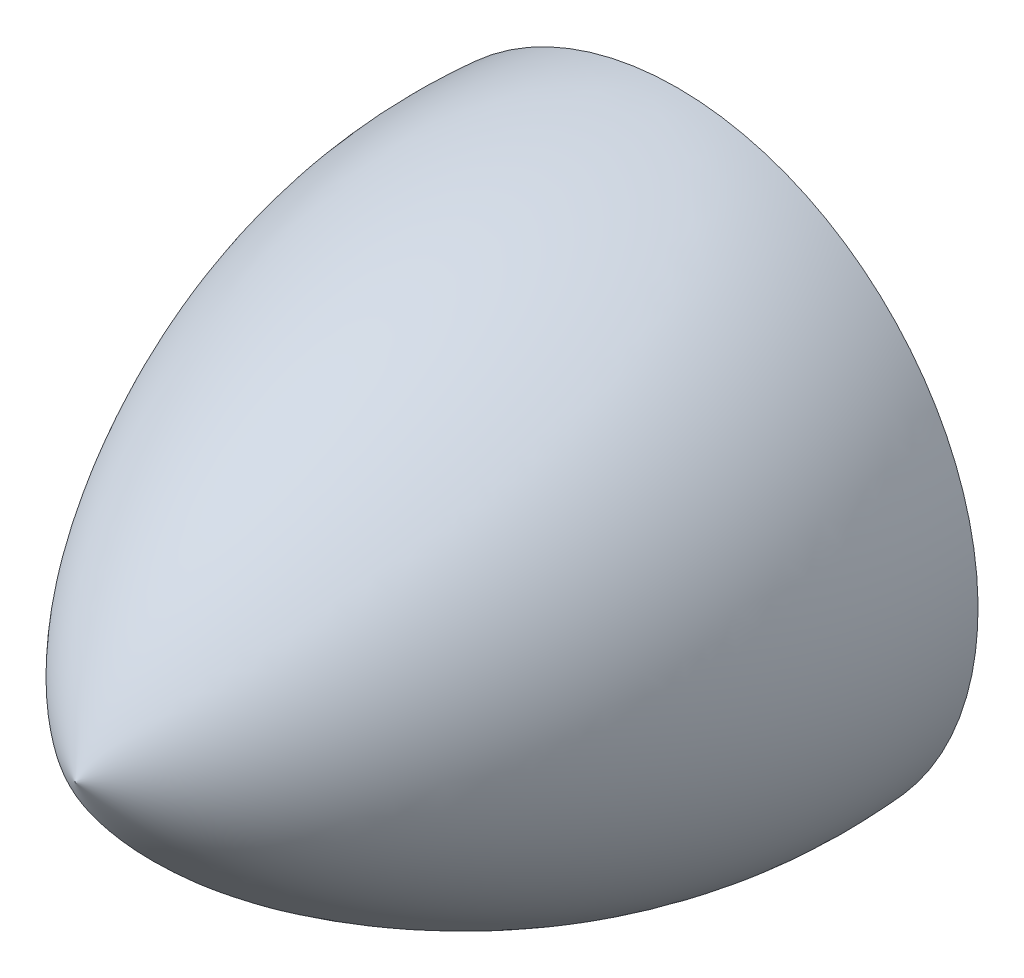
ISO-10303-21;
HEADER;
FILE_DESCRIPTION(('STEP AP214'),'2;1');
FILE_NAME('part.step','',(''),(''),'','','');
FILE_SCHEMA(('AUTOMOTIVE_DESIGN { 1 0 10303 214 1 1 1 1 }'));
ENDSEC;
DATA;
#1=APPLICATION_CONTEXT('core data for automotive mechanical design processes');
#2=APPLICATION_PROTOCOL_DEFINITION('international standard','automotive_design',2000,#1);
#3=PRODUCT_CONTEXT('',#1,'mechanical');
#4=PRODUCT('Part','Part','',(#3));
#5=PRODUCT_RELATED_PRODUCT_CATEGORY('part','',(#4));
#6=PRODUCT_DEFINITION_FORMATION('','',#4);
#7=PRODUCT_DEFINITION_CONTEXT('part definition',#1,'design');
#8=PRODUCT_DEFINITION('design','',#6,#7);
#9=PRODUCT_DEFINITION_SHAPE('','',#8);
#10=(LENGTH_UNIT() NAMED_UNIT(*) SI_UNIT(.MILLI.,.METRE.));
#11=(NAMED_UNIT(*) PLANE_ANGLE_UNIT() SI_UNIT($,.RADIAN.));
#12=(NAMED_UNIT(*) SI_UNIT($,.STERADIAN.) SOLID_ANGLE_UNIT());
#13=UNCERTAINTY_MEASURE_WITH_UNIT(LENGTH_MEASURE(1.E-05),#10,'distance_accuracy_value','');
#14=(GEOMETRIC_REPRESENTATION_CONTEXT(3) GLOBAL_UNCERTAINTY_ASSIGNED_CONTEXT((#13)) GLOBAL_UNIT_ASSIGNED_CONTEXT((#10,
#11,#12)) REPRESENTATION_CONTEXT('',''));
#15=CARTESIAN_POINT('',(0.,0.,0.));
#16=DIRECTION('',(0.,0.,1.));
#17=DIRECTION('',(1.,0.,0.));
#18=AXIS2_PLACEMENT_3D('',#15,#16,#17);
#19=CARTESIAN_POINT('',(0.,0.,0.));
#20=DIRECTION('',(0.,0.,-1.));
#21=DIRECTION('',(0.,1.,0.));
#22=AXIS2_PLACEMENT_3D('',#19,#20,#21);
#23=PLANE('',#22);
#24=CARTESIAN_POINT('',(0.,0.,0.));
#25=DIRECTION('',(0.,0.,-1.));
#26=DIRECTION('',(0.,1.,0.));
#27=AXIS2_PLACEMENT_3D('',#24,#25,#26);
#28=CIRCLE('',#27,35.);
#29=CARTESIAN_POINT('',(0.,35.,0.));
#30=VERTEX_POINT('',#29);
#31=EDGE_CURVE('E11',#30,#30,#28,.T.);
#32=ORIENTED_EDGE('',*,*,#31,.T.);
#33=EDGE_LOOP('',(#32));
#34=FACE_BOUND('',#33,.T.);
#35=ADVANCED_FACE('F43',(#34),#23,.T.);
#36=CARTESIAN_POINT('',(0.,0.,70.104));
#37=CARTESIAN_POINT('',(0.,11.1696199735518,64.6187702099962));
#38=CARTESIAN_POINT('',(0.,28.804891158753,42.3480105288994));
#39=CARTESIAN_POINT('',(0.,36.2229669886693,15.5220274331634));
#40=CARTESIAN_POINT('',(0.,35.,0.));
#41=B_SPLINE_CURVE_WITH_KNOTS('',3,(#36,#37,#38,#39,#40),.UNSPECIFIED.,.F.,.F.,(4,1,4),(0.,
0.446109601402866,1.),.UNSPECIFIED.);
#42=CARTESIAN_POINT('',(0.,0.,0.));
#43=DIRECTION('',(0.,0.,-1.));
#44=AXIS1_PLACEMENT('',#42,#43);
#45=SURFACE_OF_REVOLUTION('',#41,#44);
#46=ORIENTED_EDGE('',*,*,#31,.F.);
#47=EDGE_LOOP('',(#46));
#48=FACE_BOUND('',#47,.T.);
#49=CARTESIAN_POINT('',(0.,0.,70.104));
#50=VERTEX_POINT('',#49);
#51=VERTEX_LOOP('',#50);
#52=FACE_BOUND('',#51,.T.);
#53=ADVANCED_FACE('F51',(#48,#52),#45,.T.);
#54=CLOSED_SHELL('',(#35,#53));
#55=MANIFOLD_SOLID_BREP('B2',#54);
#56=ADVANCED_BREP_SHAPE_REPRESENTATION('',(#18,#55),#14);
#57=SHAPE_DEFINITION_REPRESENTATION(#9,#56);
ENDSEC;
END-ISO-10303-21;
